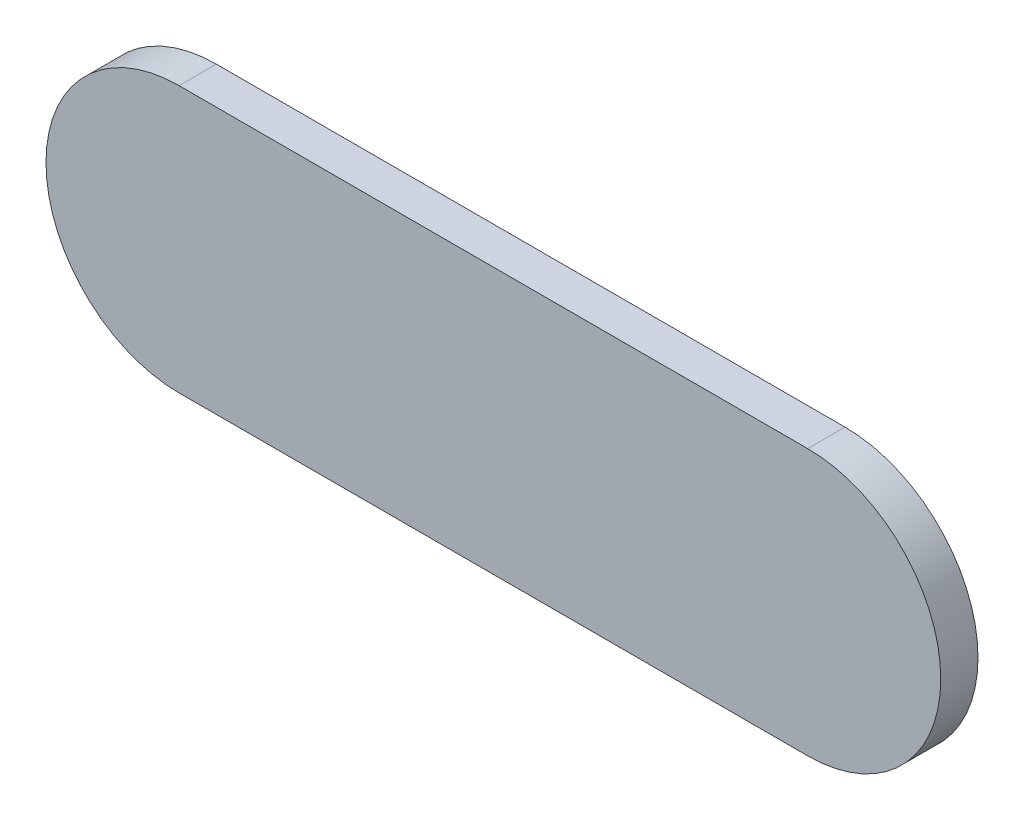
ISO-10303-21;
HEADER;
FILE_DESCRIPTION(('STEP AP214'),'2;1');
FILE_NAME('part.step','',(''),(''),'','','');
FILE_SCHEMA(('AUTOMOTIVE_DESIGN { 1 0 10303 214 1 1 1 1 }'));
ENDSEC;
DATA;
#1=APPLICATION_CONTEXT('core data for automotive mechanical design processes');
#2=APPLICATION_PROTOCOL_DEFINITION('international standard','automotive_design',2000,#1);
#3=PRODUCT_CONTEXT('',#1,'mechanical');
#4=PRODUCT('Part','Part','',(#3));
#5=PRODUCT_RELATED_PRODUCT_CATEGORY('part','',(#4));
#6=PRODUCT_DEFINITION_FORMATION('','',#4);
#7=PRODUCT_DEFINITION_CONTEXT('part definition',#1,'design');
#8=PRODUCT_DEFINITION('design','',#6,#7);
#9=PRODUCT_DEFINITION_SHAPE('','',#8);
#10=(LENGTH_UNIT() NAMED_UNIT(*) SI_UNIT(.MILLI.,.METRE.));
#11=(NAMED_UNIT(*) PLANE_ANGLE_UNIT() SI_UNIT($,.RADIAN.));
#12=(NAMED_UNIT(*) SI_UNIT($,.STERADIAN.) SOLID_ANGLE_UNIT());
#13=UNCERTAINTY_MEASURE_WITH_UNIT(LENGTH_MEASURE(1.E-05),#10,'distance_accuracy_value','');
#14=(GEOMETRIC_REPRESENTATION_CONTEXT(3) GLOBAL_UNCERTAINTY_ASSIGNED_CONTEXT((#13)) GLOBAL_UNIT_ASSIGNED_CONTEXT((#10,
#11,#12)) REPRESENTATION_CONTEXT('',''));
#15=CARTESIAN_POINT('',(0.,0.,0.));
#16=DIRECTION('',(0.,0.,1.));
#17=DIRECTION('',(1.,0.,0.));
#18=AXIS2_PLACEMENT_3D('',#15,#16,#17);
#19=CARTESIAN_POINT('',(82.2169552,67.8100244,0.));
#20=DIRECTION('',(0.,1.,0.));
#21=DIRECTION('',(1.,0.,0.));
#22=AXIS2_PLACEMENT_3D('',#19,#20,#21);
#23=PLANE('',#22);
#24=DIRECTION('',(1.,0.,0.));
#25=VECTOR('',#24,1.);
#26=CARTESIAN_POINT('',(82.2169552,67.8100244,0.03556));
#27=LINE('',#26,#25);
#28=CARTESIAN_POINT('',(82.2169552,67.8100244,0.03556));
#29=VERTEX_POINT('',#28);
#30=CARTESIAN_POINT('',(82.816954,67.8100244,0.03556));
#31=VERTEX_POINT('',#30);
#32=EDGE_CURVE('E11',#29,#31,#27,.T.);
#33=ORIENTED_EDGE('',*,*,#32,.F.);
#34=DIRECTION('',(0.,0.,1.));
#35=VECTOR('',#34,1.);
#36=CARTESIAN_POINT('',(82.2169552,67.8100244,0.));
#37=LINE('',#36,#35);
#38=CARTESIAN_POINT('',(82.2169552,67.8100244,0.));
#39=VERTEX_POINT('',#38);
#40=EDGE_CURVE('E24',#39,#29,#37,.T.);
#41=ORIENTED_EDGE('',*,*,#40,.F.);
#42=DIRECTION('',(1.,0.,0.));
#43=VECTOR('',#42,1.);
#44=CARTESIAN_POINT('',(82.2169552,67.8100244,0.));
#45=LINE('',#44,#43);
#46=CARTESIAN_POINT('',(82.816954,67.8100244,0.));
#47=VERTEX_POINT('',#46);
#48=EDGE_CURVE('E75',#39,#47,#45,.T.);
#49=ORIENTED_EDGE('',*,*,#48,.T.);
#50=DIRECTION('',(0.,0.,1.));
#51=VECTOR('',#50,1.);
#52=CARTESIAN_POINT('',(82.816954,67.8100244,0.));
#53=LINE('',#52,#51);
#54=EDGE_CURVE('E37',#47,#31,#53,.T.);
#55=ORIENTED_EDGE('',*,*,#54,.T.);
#56=EDGE_LOOP('',(#33,#41,#49,#55));
#57=FACE_BOUND('',#56,.T.);
#58=ADVANCED_FACE('F17',(#57),#23,.F.);
#59=CARTESIAN_POINT('',(82.816954,67.9370244,0.));
#60=DIRECTION('',(0.,0.,-1.));
#61=DIRECTION('',(1.11896493820492E-13,-1.,0.));
#62=AXIS2_PLACEMENT_3D('',#59,#60,#61);
#63=CYLINDRICAL_SURFACE('',#62,0.127000000000005);
#64=CARTESIAN_POINT('',(82.816954,67.9370244,0.03556));
#65=DIRECTION('',(0.,0.,1.));
#66=DIRECTION('',(1.11896493820492E-13,-1.,0.));
#67=AXIS2_PLACEMENT_3D('',#64,#65,#66);
#68=CIRCLE('',#67,0.127000000000005);
#69=CARTESIAN_POINT('',(82.816954,68.0640244,0.03556));
#70=VERTEX_POINT('',#69);
#71=EDGE_CURVE('E83',#31,#70,#68,.T.);
#72=ORIENTED_EDGE('',*,*,#71,.F.);
#73=ORIENTED_EDGE('',*,*,#54,.F.);
#74=CARTESIAN_POINT('',(82.816954,67.9370244,0.));
#75=DIRECTION('',(0.,0.,1.));
#76=DIRECTION('',(1.11896493820492E-13,-1.,0.));
#77=AXIS2_PLACEMENT_3D('',#74,#75,#76);
#78=CIRCLE('',#77,0.127000000000005);
#79=CARTESIAN_POINT('',(82.816954,68.0640244,0.));
#80=VERTEX_POINT('',#79);
#81=EDGE_CURVE('E81',#47,#80,#78,.T.);
#82=ORIENTED_EDGE('',*,*,#81,.T.);
#83=DIRECTION('',(0.,0.,1.));
#84=VECTOR('',#83,1.);
#85=CARTESIAN_POINT('',(82.816954,68.0640244,0.));
#86=LINE('',#85,#84);
#87=EDGE_CURVE('E67',#80,#70,#86,.T.);
#88=ORIENTED_EDGE('',*,*,#87,.T.);
#89=EDGE_LOOP('',(#72,#73,#82,#88));
#90=FACE_BOUND('',#89,.T.);
#91=ADVANCED_FACE('F89',(#90),#63,.T.);
#92=CARTESIAN_POINT('',(82.816954,68.0640244,0.));
#93=DIRECTION('',(0.,-1.,0.));
#94=DIRECTION('',(-1.,0.,0.));
#95=AXIS2_PLACEMENT_3D('',#92,#93,#94);
#96=PLANE('',#95);
#97=DIRECTION('',(-1.,0.,0.));
#98=VECTOR('',#97,1.);
#99=CARTESIAN_POINT('',(82.816954,68.0640244,0.03556));
#100=LINE('',#99,#98);
#101=CARTESIAN_POINT('',(82.2169552,68.0640244,0.03556));
#102=VERTEX_POINT('',#101);
#103=EDGE_CURVE('E71',#70,#102,#100,.T.);
#104=ORIENTED_EDGE('',*,*,#103,.F.);
#105=ORIENTED_EDGE('',*,*,#87,.F.);
#106=DIRECTION('',(-1.,0.,0.));
#107=VECTOR('',#106,1.);
#108=CARTESIAN_POINT('',(82.816954,68.0640244,0.));
#109=LINE('',#108,#107);
#110=CARTESIAN_POINT('',(82.2169552,68.0640244,0.));
#111=VERTEX_POINT('',#110);
#112=EDGE_CURVE('E63',#80,#111,#109,.T.);
#113=ORIENTED_EDGE('',*,*,#112,.T.);
#114=DIRECTION('',(0.,0.,1.));
#115=VECTOR('',#114,1.);
#116=CARTESIAN_POINT('',(82.2169552,68.0640244,0.));
#117=LINE('',#116,#115);
#118=EDGE_CURVE('E53',#111,#102,#117,.T.);
#119=ORIENTED_EDGE('',*,*,#118,.T.);
#120=EDGE_LOOP('',(#104,#105,#113,#119));
#121=FACE_BOUND('',#120,.T.);
#122=ADVANCED_FACE('F66',(#121),#96,.F.);
#123=CARTESIAN_POINT('',(82.2169552,67.9370244,0.));
#124=DIRECTION('',(0.,0.,-1.));
#125=DIRECTION('',(-1.1189649382048E-13,1.,0.));
#126=AXIS2_PLACEMENT_3D('',#123,#124,#125);
#127=CYLINDRICAL_SURFACE('',#126,0.127000000000005);
#128=CARTESIAN_POINT('',(82.2169552,67.9370244,0.03556));
#129=DIRECTION('',(0.,0.,1.));
#130=DIRECTION('',(-1.1189649382048E-13,1.,0.));
#131=AXIS2_PLACEMENT_3D('',#128,#129,#130);
#132=CIRCLE('',#131,0.127000000000005);
#133=EDGE_CURVE('E59',#102,#29,#132,.T.);
#134=ORIENTED_EDGE('',*,*,#133,.F.);
#135=ORIENTED_EDGE('',*,*,#118,.F.);
#136=CARTESIAN_POINT('',(82.2169552,67.9370244,0.));
#137=DIRECTION('',(0.,0.,1.));
#138=DIRECTION('',(-1.1189649382048E-13,1.,0.));
#139=AXIS2_PLACEMENT_3D('',#136,#137,#138);
#140=CIRCLE('',#139,0.127000000000005);
#141=EDGE_CURVE('E57',#111,#39,#140,.T.);
#142=ORIENTED_EDGE('',*,*,#141,.T.);
#143=ORIENTED_EDGE('',*,*,#40,.T.);
#144=EDGE_LOOP('',(#134,#135,#142,#143));
#145=FACE_BOUND('',#144,.T.);
#146=ADVANCED_FACE('F55',(#145),#127,.T.);
#147=CARTESIAN_POINT('',(82.2169552,67.8100244,0.));
#148=DIRECTION('',(0.,0.,-1.));
#149=DIRECTION('',(-1.,0.,0.));
#150=AXIS2_PLACEMENT_3D('',#147,#148,#149);
#151=PLANE('',#150);
#152=ORIENTED_EDGE('',*,*,#141,.F.);
#153=ORIENTED_EDGE('',*,*,#112,.F.);
#154=ORIENTED_EDGE('',*,*,#81,.F.);
#155=ORIENTED_EDGE('',*,*,#48,.F.);
#156=EDGE_LOOP('',(#152,#153,#154,#155));
#157=FACE_BOUND('',#156,.T.);
#158=ADVANCED_FACE('F74',(#157),#151,.T.);
#159=CARTESIAN_POINT('',(82.2169552,67.8100244,0.03556));
#160=DIRECTION('',(0.,0.,-1.));
#161=DIRECTION('',(-1.,0.,0.));
#162=AXIS2_PLACEMENT_3D('',#159,#160,#161);
#163=PLANE('',#162);
#164=ORIENTED_EDGE('',*,*,#32,.T.);
#165=ORIENTED_EDGE('',*,*,#71,.T.);
#166=ORIENTED_EDGE('',*,*,#103,.T.);
#167=ORIENTED_EDGE('',*,*,#133,.T.);
#168=EDGE_LOOP('',(#164,#165,#166,#167));
#169=FACE_BOUND('',#168,.T.);
#170=ADVANCED_FACE('F91',(#169),#163,.F.);
#171=CLOSED_SHELL('',(#58,#91,#122,#146,#158,#170));
#172=MANIFOLD_SOLID_BREP('B1',#171);
#173=ADVANCED_BREP_SHAPE_REPRESENTATION('',(#18,#172),#14);
#174=SHAPE_DEFINITION_REPRESENTATION(#9,#173);
ENDSEC;
END-ISO-10303-21;
